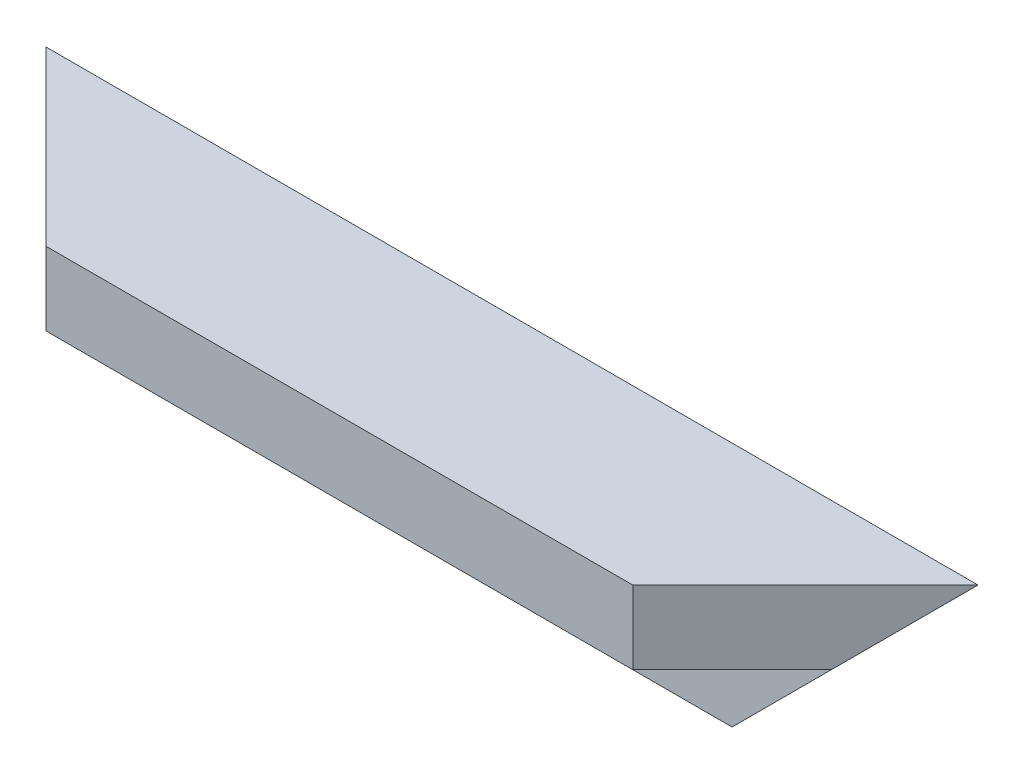
ISO-10303-21;
HEADER;
FILE_DESCRIPTION(('STEP AP214'),'2;1');
FILE_NAME('part.step','',(''),(''),'','','');
FILE_SCHEMA(('AUTOMOTIVE_DESIGN { 1 0 10303 214 1 1 1 1 }'));
ENDSEC;
DATA;
#1=APPLICATION_CONTEXT('core data for automotive mechanical design processes');
#2=APPLICATION_PROTOCOL_DEFINITION('international standard','automotive_design',2000,#1);
#3=PRODUCT_CONTEXT('',#1,'mechanical');
#4=PRODUCT('Part','Part','',(#3));
#5=PRODUCT_RELATED_PRODUCT_CATEGORY('part','',(#4));
#6=PRODUCT_DEFINITION_FORMATION('','',#4);
#7=PRODUCT_DEFINITION_CONTEXT('part definition',#1,'design');
#8=PRODUCT_DEFINITION('design','',#6,#7);
#9=PRODUCT_DEFINITION_SHAPE('','',#8);
#10=(LENGTH_UNIT() NAMED_UNIT(*) SI_UNIT(.MILLI.,.METRE.));
#11=(NAMED_UNIT(*) PLANE_ANGLE_UNIT() SI_UNIT($,.RADIAN.));
#12=(NAMED_UNIT(*) SI_UNIT($,.STERADIAN.) SOLID_ANGLE_UNIT());
#13=UNCERTAINTY_MEASURE_WITH_UNIT(LENGTH_MEASURE(1.E-05),#10,'distance_accuracy_value','');
#14=(GEOMETRIC_REPRESENTATION_CONTEXT(3) GLOBAL_UNCERTAINTY_ASSIGNED_CONTEXT((#13)) GLOBAL_UNIT_ASSIGNED_CONTEXT((#10,
#11,#12)) REPRESENTATION_CONTEXT('',''));
#15=CARTESIAN_POINT('',(0.,0.,0.));
#16=DIRECTION('',(0.,0.,1.));
#17=DIRECTION('',(1.,0.,0.));
#18=AXIS2_PLACEMENT_3D('',#15,#16,#17);
#19=CARTESIAN_POINT('',(216.,-40.,0.));
#20=DIRECTION('',(0.,0.,1.));
#21=DIRECTION('',(1.,0.,0.));
#22=AXIS2_PLACEMENT_3D('',#19,#20,#21);
#23=PLANE('',#22);
#24=DIRECTION('',(-1.,0.,0.));
#25=VECTOR('',#24,1.);
#26=CARTESIAN_POINT('',(216.,0.,0.));
#27=LINE('',#26,#25);
#28=CARTESIAN_POINT('',(216.,0.,0.));
#29=VERTEX_POINT('',#28);
#30=CARTESIAN_POINT('',(0.,0.,0.));
#31=VERTEX_POINT('',#30);
#32=EDGE_CURVE('E102',#29,#31,#27,.T.);
#33=ORIENTED_EDGE('',*,*,#32,.F.);
#34=DIRECTION('',(0.707106781186548,0.707106781186547,0.));
#35=VECTOR('',#34,1.);
#36=CARTESIAN_POINT('',(216.,0.,0.));
#37=LINE('',#36,#35);
#38=CARTESIAN_POINT('',(176.,-40.,0.));
#39=VERTEX_POINT('',#38);
#40=EDGE_CURVE('E87',#39,#29,#37,.T.);
#41=ORIENTED_EDGE('',*,*,#40,.F.);
#42=DIRECTION('',(-1.,0.,0.));
#43=VECTOR('',#42,1.);
#44=CARTESIAN_POINT('',(216.,-40.,0.));
#45=LINE('',#44,#43);
#46=CARTESIAN_POINT('',(40.,-40.,0.));
#47=VERTEX_POINT('',#46);
#48=EDGE_CURVE('E100',#39,#47,#45,.T.);
#49=ORIENTED_EDGE('',*,*,#48,.T.);
#50=DIRECTION('',(0.707106781186548,-0.707106781186548,0.));
#51=VECTOR('',#50,1.);
#52=CARTESIAN_POINT('',(0.,0.,0.));
#53=LINE('',#52,#51);
#54=EDGE_CURVE('E151',#31,#47,#53,.T.);
#55=ORIENTED_EDGE('',*,*,#54,.F.);
#56=EDGE_LOOP('',(#33,#41,#49,#55));
#57=FACE_BOUND('',#56,.T.);
#58=ADVANCED_FACE('F33',(#57),#23,.F.);
#59=CARTESIAN_POINT('',(216.,0.,0.));
#60=DIRECTION('',(0.,-1.,0.));
#61=DIRECTION('',(0.,0.,-1.));
#62=AXIS2_PLACEMENT_3D('',#59,#60,#61);
#63=PLANE('',#62);
#64=DIRECTION('',(-1.,0.,0.));
#65=VECTOR('',#64,1.);
#66=CARTESIAN_POINT('',(216.,0.,40.));
#67=LINE('',#66,#65);
#68=CARTESIAN_POINT('',(176.,0.,40.));
#69=VERTEX_POINT('',#68);
#70=CARTESIAN_POINT('',(40.,0.,40.));
#71=VERTEX_POINT('',#70);
#72=EDGE_CURVE('E121',#69,#71,#67,.T.);
#73=ORIENTED_EDGE('',*,*,#72,.F.);
#74=DIRECTION('',(-0.707106781186548,0.,0.707106781186547));
#75=VECTOR('',#74,1.);
#76=CARTESIAN_POINT('',(216.,0.,0.));
#77=LINE('',#76,#75);
#78=EDGE_CURVE('E126',#29,#69,#77,.T.);
#79=ORIENTED_EDGE('',*,*,#78,.F.);
#80=ORIENTED_EDGE('',*,*,#32,.T.);
#81=DIRECTION('',(-0.707106781186548,0.,-0.707106781186547));
#82=VECTOR('',#81,1.);
#83=CARTESIAN_POINT('',(40.,0.,40.));
#84=LINE('',#83,#82);
#85=EDGE_CURVE('E135',#71,#31,#84,.T.);
#86=ORIENTED_EDGE('',*,*,#85,.F.);
#87=EDGE_LOOP('',(#73,#79,#80,#86));
#88=FACE_BOUND('',#87,.T.);
#89=ADVANCED_FACE('F130',(#88),#63,.F.);
#90=CARTESIAN_POINT('',(216.,0.,40.));
#91=DIRECTION('',(0.,0.,-1.));
#92=DIRECTION('',(-1.,0.,0.));
#93=AXIS2_PLACEMENT_3D('',#90,#91,#92);
#94=PLANE('',#93);
#95=DIRECTION('',(-1.,0.,0.));
#96=VECTOR('',#95,1.);
#97=CARTESIAN_POINT('',(216.,-17.,40.));
#98=LINE('',#97,#96);
#99=CARTESIAN_POINT('',(176.,-17.,40.));
#100=VERTEX_POINT('',#99);
#101=CARTESIAN_POINT('',(40.,-17.,40.));
#102=VERTEX_POINT('',#101);
#103=EDGE_CURVE('E118',#100,#102,#98,.T.);
#104=ORIENTED_EDGE('',*,*,#103,.F.);
#105=DIRECTION('',(0.,1.,0.));
#106=VECTOR('',#105,1.);
#107=CARTESIAN_POINT('',(176.,-40.,40.));
#108=LINE('',#107,#106);
#109=EDGE_CURVE('E47',#100,#69,#108,.T.);
#110=ORIENTED_EDGE('',*,*,#109,.T.);
#111=ORIENTED_EDGE('',*,*,#72,.T.);
#112=DIRECTION('',(0.,1.,0.));
#113=VECTOR('',#112,1.);
#114=CARTESIAN_POINT('',(40.,-40.,40.));
#115=LINE('',#114,#113);
#116=EDGE_CURVE('E132',#102,#71,#115,.T.);
#117=ORIENTED_EDGE('',*,*,#116,.F.);
#118=EDGE_LOOP('',(#104,#110,#111,#117));
#119=FACE_BOUND('',#118,.T.);
#120=ADVANCED_FACE('F155',(#119),#94,.F.);
#121=CARTESIAN_POINT('',(216.,-17.,40.));
#122=DIRECTION('',(0.,1.,0.));
#123=DIRECTION('',(0.,0.,1.));
#124=AXIS2_PLACEMENT_3D('',#121,#122,#123);
#125=PLANE('',#124);
#126=DIRECTION('',(-1.,0.,0.));
#127=VECTOR('',#126,1.);
#128=CARTESIAN_POINT('',(216.,-17.,17.));
#129=LINE('',#128,#127);
#130=CARTESIAN_POINT('',(199.,-17.,17.));
#131=VERTEX_POINT('',#130);
#132=CARTESIAN_POINT('',(17.,-17.,17.));
#133=VERTEX_POINT('',#132);
#134=EDGE_CURVE('E110',#131,#133,#129,.T.);
#135=ORIENTED_EDGE('',*,*,#134,.F.);
#136=DIRECTION('',(-0.707106781186548,0.,0.707106781186548));
#137=VECTOR('',#136,1.);
#138=CARTESIAN_POINT('',(196.,-17.,20.));
#139=LINE('',#138,#137);
#140=EDGE_CURVE('E108',#131,#100,#139,.T.);
#141=ORIENTED_EDGE('',*,*,#140,.T.);
#142=ORIENTED_EDGE('',*,*,#103,.T.);
#143=DIRECTION('',(-0.707106781186548,0.,-0.707106781186548));
#144=VECTOR('',#143,1.);
#145=CARTESIAN_POINT('',(128.,-17.,128.));
#146=LINE('',#145,#144);
#147=EDGE_CURVE('E112',#102,#133,#146,.T.);
#148=ORIENTED_EDGE('',*,*,#147,.T.);
#149=EDGE_LOOP('',(#135,#141,#142,#148));
#150=FACE_BOUND('',#149,.T.);
#151=ADVANCED_FACE('F143',(#150),#125,.F.);
#152=CARTESIAN_POINT('',(216.,-17.,17.));
#153=DIRECTION('',(0.,0.,-1.));
#154=DIRECTION('',(0.,1.,0.));
#155=AXIS2_PLACEMENT_3D('',#152,#153,#154);
#156=PLANE('',#155);
#157=DIRECTION('',(-1.,0.,0.));
#158=VECTOR('',#157,1.);
#159=CARTESIAN_POINT('',(216.,-40.,17.));
#160=LINE('',#159,#158);
#161=CARTESIAN_POINT('',(176.,-40.,17.));
#162=VERTEX_POINT('',#161);
#163=CARTESIAN_POINT('',(40.,-40.,17.));
#164=VERTEX_POINT('',#163);
#165=EDGE_CURVE('E107',#162,#164,#160,.T.);
#166=ORIENTED_EDGE('',*,*,#165,.F.);
#167=DIRECTION('',(0.707106781186548,0.707106781186547,0.));
#168=VECTOR('',#167,1.);
#169=CARTESIAN_POINT('',(207.5,-8.5,17.));
#170=LINE('',#169,#168);
#171=EDGE_CURVE('E90',#162,#131,#170,.T.);
#172=ORIENTED_EDGE('',*,*,#171,.T.);
#173=ORIENTED_EDGE('',*,*,#134,.T.);
#174=DIRECTION('',(0.707106781186548,-0.707106781186548,0.));
#175=VECTOR('',#174,1.);
#176=CARTESIAN_POINT('',(116.5,-116.5,17.));
#177=LINE('',#176,#175);
#178=EDGE_CURVE('E55',#133,#164,#177,.T.);
#179=ORIENTED_EDGE('',*,*,#178,.T.);
#180=EDGE_LOOP('',(#166,#172,#173,#179));
#181=FACE_BOUND('',#180,.T.);
#182=ADVANCED_FACE('F148',(#181),#156,.F.);
#183=CARTESIAN_POINT('',(216.,-40.,17.));
#184=DIRECTION('',(0.,1.,0.));
#185=DIRECTION('',(0.,0.,1.));
#186=AXIS2_PLACEMENT_3D('',#183,#184,#185);
#187=PLANE('',#186);
#188=ORIENTED_EDGE('',*,*,#48,.F.);
#189=DIRECTION('',(0.,0.,-1.));
#190=VECTOR('',#189,1.);
#191=CARTESIAN_POINT('',(176.,-40.,40.));
#192=LINE('',#191,#190);
#193=EDGE_CURVE('E84',#162,#39,#192,.T.);
#194=ORIENTED_EDGE('',*,*,#193,.F.);
#195=ORIENTED_EDGE('',*,*,#165,.T.);
#196=DIRECTION('',(0.,0.,-1.));
#197=VECTOR('',#196,1.);
#198=CARTESIAN_POINT('',(40.,-40.,40.));
#199=LINE('',#198,#197);
#200=EDGE_CURVE('E103',#164,#47,#199,.T.);
#201=ORIENTED_EDGE('',*,*,#200,.T.);
#202=EDGE_LOOP('',(#188,#194,#195,#201));
#203=FACE_BOUND('',#202,.T.);
#204=ADVANCED_FACE('F106',(#203),#187,.F.);
#205=CARTESIAN_POINT('',(40.,-40.,40.));
#206=DIRECTION('',(0.707106781186548,0.,-0.707106781186548));
#207=DIRECTION('',(-0.707106781186548,0.,-0.707106781186548));
#208=AXIS2_PLACEMENT_3D('',#205,#206,#207);
#209=PLANE('',#208);
#210=ORIENTED_EDGE('',*,*,#85,.T.);
#211=DIRECTION('',(0.577350269189626,-0.577350269189626,0.577350269189626));
#212=VECTOR('',#211,1.);
#213=CARTESIAN_POINT('',(40.,-40.,40.));
#214=LINE('',#213,#212);
#215=EDGE_CURVE('E11',#31,#133,#214,.T.);
#216=ORIENTED_EDGE('',*,*,#215,.T.);
#217=ORIENTED_EDGE('',*,*,#147,.F.);
#218=ORIENTED_EDGE('',*,*,#116,.T.);
#219=EDGE_LOOP('',(#210,#216,#217,#218));
#220=FACE_BOUND('',#219,.T.);
#221=ADVANCED_FACE('F153',(#220),#209,.F.);
#222=CARTESIAN_POINT('',(216.,-40.,0.));
#223=DIRECTION('',(-0.707106781186548,0.,-0.707106781186548));
#224=DIRECTION('',(-0.707106781186548,0.,0.707106781186548));
#225=AXIS2_PLACEMENT_3D('',#222,#223,#224);
#226=PLANE('',#225);
#227=ORIENTED_EDGE('',*,*,#140,.F.);
#228=DIRECTION('',(0.577350269189626,0.577350269189626,-0.577350269189626));
#229=VECTOR('',#228,1.);
#230=CARTESIAN_POINT('',(202.666666666667,-13.3333333333333,13.3333333333333));
#231=LINE('',#230,#229);
#232=EDGE_CURVE('E40',#131,#29,#231,.T.);
#233=ORIENTED_EDGE('',*,*,#232,.T.);
#234=ORIENTED_EDGE('',*,*,#78,.T.);
#235=ORIENTED_EDGE('',*,*,#109,.F.);
#236=EDGE_LOOP('',(#227,#233,#234,#235));
#237=FACE_BOUND('',#236,.T.);
#238=ADVANCED_FACE('F125',(#237),#226,.F.);
#239=CARTESIAN_POINT('',(216.,0.,40.));
#240=DIRECTION('',(-0.707106781186547,0.707106781186548,0.));
#241=DIRECTION('',(-0.707106781186548,-0.707106781186547,0.));
#242=AXIS2_PLACEMENT_3D('',#239,#240,#241);
#243=PLANE('',#242);
#244=ORIENTED_EDGE('',*,*,#193,.T.);
#245=ORIENTED_EDGE('',*,*,#40,.T.);
#246=ORIENTED_EDGE('',*,*,#232,.F.);
#247=ORIENTED_EDGE('',*,*,#171,.F.);
#248=EDGE_LOOP('',(#244,#245,#246,#247));
#249=FACE_BOUND('',#248,.T.);
#250=ADVANCED_FACE('F86',(#249),#243,.F.);
#251=CARTESIAN_POINT('',(0.,0.,40.));
#252=DIRECTION('',(0.707106781186548,0.707106781186548,0.));
#253=DIRECTION('',(-0.707106781186548,0.707106781186548,0.));
#254=AXIS2_PLACEMENT_3D('',#251,#252,#253);
#255=PLANE('',#254);
#256=ORIENTED_EDGE('',*,*,#215,.F.);
#257=ORIENTED_EDGE('',*,*,#54,.T.);
#258=ORIENTED_EDGE('',*,*,#200,.F.);
#259=ORIENTED_EDGE('',*,*,#178,.F.);
#260=EDGE_LOOP('',(#256,#257,#258,#259));
#261=FACE_BOUND('',#260,.T.);
#262=ADVANCED_FACE('F152',(#261),#255,.F.);
#263=CLOSED_SHELL('',(#58,#89,#120,#151,#182,#204,#221,#238,#250,#262));
#264=MANIFOLD_SOLID_BREP('B2',#263);
#265=ADVANCED_BREP_SHAPE_REPRESENTATION('',(#18,#264),#14);
#266=SHAPE_DEFINITION_REPRESENTATION(#9,#265);
ENDSEC;
END-ISO-10303-21;
